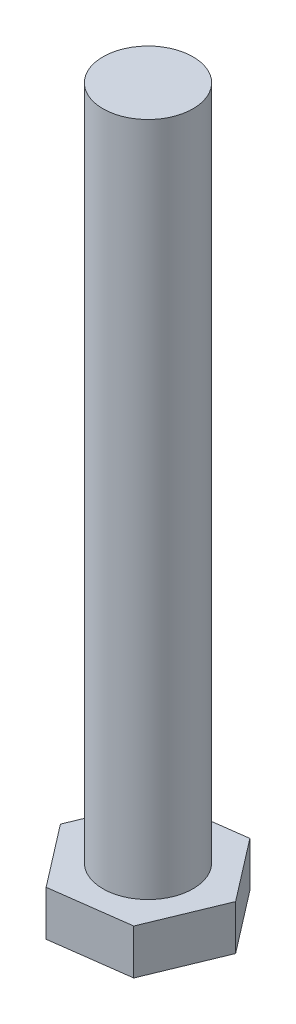
ISO-10303-21;
HEADER;
FILE_DESCRIPTION(('STEP AP214'),'2;1');
FILE_NAME('part.step','',(''),(''),'','','');
FILE_SCHEMA(('AUTOMOTIVE_DESIGN { 1 0 10303 214 1 1 1 1 }'));
ENDSEC;
DATA;
#1=APPLICATION_CONTEXT('core data for automotive mechanical design processes');
#2=APPLICATION_PROTOCOL_DEFINITION('international standard','automotive_design',2000,#1);
#3=PRODUCT_CONTEXT('',#1,'mechanical');
#4=PRODUCT('Part','Part','',(#3));
#5=PRODUCT_RELATED_PRODUCT_CATEGORY('part','',(#4));
#6=PRODUCT_DEFINITION_FORMATION('','',#4);
#7=PRODUCT_DEFINITION_CONTEXT('part definition',#1,'design');
#8=PRODUCT_DEFINITION('design','',#6,#7);
#9=PRODUCT_DEFINITION_SHAPE('','',#8);
#10=(LENGTH_UNIT() NAMED_UNIT(*) SI_UNIT(.MILLI.,.METRE.));
#11=(NAMED_UNIT(*) PLANE_ANGLE_UNIT() SI_UNIT($,.RADIAN.));
#12=(NAMED_UNIT(*) SI_UNIT($,.STERADIAN.) SOLID_ANGLE_UNIT());
#13=UNCERTAINTY_MEASURE_WITH_UNIT(LENGTH_MEASURE(1.E-05),#10,'distance_accuracy_value','');
#14=(GEOMETRIC_REPRESENTATION_CONTEXT(3) GLOBAL_UNCERTAINTY_ASSIGNED_CONTEXT((#13)) GLOBAL_UNIT_ASSIGNED_CONTEXT((#10,
#11,#12)) REPRESENTATION_CONTEXT('',''));
#15=CARTESIAN_POINT('',(0.,0.,0.));
#16=DIRECTION('',(0.,0.,1.));
#17=DIRECTION('',(1.,0.,0.));
#18=AXIS2_PLACEMENT_3D('',#15,#16,#17);
#19=CARTESIAN_POINT('',(0.,2.,0.));
#20=DIRECTION('',(0.,1.,0.));
#21=DIRECTION('',(0.,0.,1.));
#22=AXIS2_PLACEMENT_3D('',#19,#20,#21);
#23=PLANE('',#22);
#24=DIRECTION('',(0.991287890638389,0.,-0.13171301330428));
#25=VECTOR('',#24,1.);
#26=CARTESIAN_POINT('',(-1.32182195160064,2.,3.20199730297618));
#27=LINE('',#26,#25);
#28=CARTESIAN_POINT('',(-1.32182195160064,2.,3.20199730297618));
#29=VERTEX_POINT('',#28);
#30=CARTESIAN_POINT('',(2.11210003142631,2.,2.74573004085416));
#31=VERTEX_POINT('',#30);
#32=EDGE_CURVE('E129',#29,#31,#27,.T.);
#33=ORIENTED_EDGE('',*,*,#32,.T.);
#34=DIRECTION('',(0.38157712978869,0.,-0.924337002408876));
#35=VECTOR('',#34,1.);
#36=CARTESIAN_POINT('',(2.11210003142631,2.,2.74573004085416));
#37=LINE('',#36,#35);
#38=CARTESIAN_POINT('',(3.43392198302694,2.,-0.456267262122023));
#39=VERTEX_POINT('',#38);
#40=EDGE_CURVE('E87',#31,#39,#37,.T.);
#41=ORIENTED_EDGE('',*,*,#40,.T.);
#42=DIRECTION('',(-0.6097107608497,0.,-0.792623989104594));
#43=VECTOR('',#42,1.);
#44=CARTESIAN_POINT('',(3.43392198302694,2.,-0.456267262122023));
#45=LINE('',#44,#43);
#46=CARTESIAN_POINT('',(1.32182195160062,2.,-3.20199730297618));
#47=VERTEX_POINT('',#46);
#48=EDGE_CURVE('E100',#39,#47,#45,.T.);
#49=ORIENTED_EDGE('',*,*,#48,.T.);
#50=DIRECTION('',(-0.991287890638389,0.,0.131713013304283));
#51=VECTOR('',#50,1.);
#52=CARTESIAN_POINT('',(1.32182195160062,2.,-3.20199730297618));
#53=LINE('',#52,#51);
#54=CARTESIAN_POINT('',(-2.11210003142631,2.,-2.74573004085415));
#55=VERTEX_POINT('',#54);
#56=EDGE_CURVE('E94',#47,#55,#53,.T.);
#57=ORIENTED_EDGE('',*,*,#56,.T.);
#58=DIRECTION('',(-0.381577129788689,0.,0.924337002408876));
#59=VECTOR('',#58,1.);
#60=CARTESIAN_POINT('',(-2.11210003142631,2.,-2.74573004085415));
#61=LINE('',#60,#59);
#62=CARTESIAN_POINT('',(-3.43392198302694,2.,0.456267262122029));
#63=VERTEX_POINT('',#62);
#64=EDGE_CURVE('E98',#55,#63,#61,.T.);
#65=ORIENTED_EDGE('',*,*,#64,.T.);
#66=DIRECTION('',(0.609710760849698,0.,0.792623989104596));
#67=VECTOR('',#66,1.);
#68=CARTESIAN_POINT('',(-3.43392198302694,2.,0.456267262122029));
#69=LINE('',#68,#67);
#70=EDGE_CURVE('E50',#63,#29,#69,.T.);
#71=ORIENTED_EDGE('',*,*,#70,.T.);
#72=EDGE_LOOP('',(#33,#41,#49,#57,#65,#71));
#73=FACE_BOUND('',#72,.T.);
#74=CARTESIAN_POINT('',(0.,2.,0.));
#75=DIRECTION('',(0.,1.,0.));
#76=DIRECTION('',(0.,0.,1.));
#77=AXIS2_PLACEMENT_3D('',#74,#75,#76);
#78=CIRCLE('',#77,2.);
#79=CARTESIAN_POINT('',(0.,2.,2.));
#80=VERTEX_POINT('',#79);
#81=EDGE_CURVE('E169',#80,#80,#78,.T.);
#82=ORIENTED_EDGE('',*,*,#81,.F.);
#83=EDGE_LOOP('',(#82));
#84=FACE_BOUND('',#83,.T.);
#85=ADVANCED_FACE('F33',(#73,#84),#23,.T.);
#86=CARTESIAN_POINT('',(-1.32182195160064,2.,3.20199730297618));
#87=DIRECTION('',(-0.13171301330428,0.,-0.991287890638389));
#88=DIRECTION('',(-0.991287890638389,0.,0.13171301330428));
#89=AXIS2_PLACEMENT_3D('',#86,#87,#88);
#90=PLANE('',#89);
#91=DIRECTION('',(0.991287890638389,0.,-0.13171301330428));
#92=VECTOR('',#91,1.);
#93=CARTESIAN_POINT('',(-1.32182195160064,0.,3.20199730297618));
#94=LINE('',#93,#92);
#95=CARTESIAN_POINT('',(-1.32182195160064,0.,3.20199730297618));
#96=VERTEX_POINT('',#95);
#97=CARTESIAN_POINT('',(2.11210003142631,0.,2.74573004085416));
#98=VERTEX_POINT('',#97);
#99=EDGE_CURVE('E118',#96,#98,#94,.T.);
#100=ORIENTED_EDGE('',*,*,#99,.T.);
#101=DIRECTION('',(0.,-1.,0.));
#102=VECTOR('',#101,1.);
#103=CARTESIAN_POINT('',(2.11210003142631,2.,2.74573004085416));
#104=LINE('',#103,#102);
#105=EDGE_CURVE('E11',#31,#98,#104,.T.);
#106=ORIENTED_EDGE('',*,*,#105,.F.);
#107=ORIENTED_EDGE('',*,*,#32,.F.);
#108=DIRECTION('',(0.,-1.,0.));
#109=VECTOR('',#108,1.);
#110=CARTESIAN_POINT('',(-1.32182195160064,2.,3.20199730297618));
#111=LINE('',#110,#109);
#112=EDGE_CURVE('E114',#29,#96,#111,.T.);
#113=ORIENTED_EDGE('',*,*,#112,.T.);
#114=EDGE_LOOP('',(#100,#106,#107,#113));
#115=FACE_BOUND('',#114,.T.);
#116=ADVANCED_FACE('F35',(#115),#90,.F.);
#117=CARTESIAN_POINT('',(2.11210003142631,2.,2.74573004085416));
#118=DIRECTION('',(-0.924337002408875,0.,-0.38157712978869));
#119=DIRECTION('',(-0.38157712978869,0.,0.924337002408876));
#120=AXIS2_PLACEMENT_3D('',#117,#118,#119);
#121=PLANE('',#120);
#122=DIRECTION('',(0.38157712978869,0.,-0.924337002408876));
#123=VECTOR('',#122,1.);
#124=CARTESIAN_POINT('',(2.11210003142631,0.,2.74573004085416));
#125=LINE('',#124,#123);
#126=CARTESIAN_POINT('',(3.43392198302694,0.,-0.456267262122023));
#127=VERTEX_POINT('',#126);
#128=EDGE_CURVE('E121',#98,#127,#125,.T.);
#129=ORIENTED_EDGE('',*,*,#128,.T.);
#130=DIRECTION('',(0.,-1.,0.));
#131=VECTOR('',#130,1.);
#132=CARTESIAN_POINT('',(3.43392198302694,2.,-0.456267262122023));
#133=LINE('',#132,#131);
#134=EDGE_CURVE('E42',#39,#127,#133,.T.);
#135=ORIENTED_EDGE('',*,*,#134,.F.);
#136=ORIENTED_EDGE('',*,*,#40,.F.);
#137=ORIENTED_EDGE('',*,*,#105,.T.);
#138=EDGE_LOOP('',(#129,#135,#136,#137));
#139=FACE_BOUND('',#138,.T.);
#140=ADVANCED_FACE('F157',(#139),#121,.F.);
#141=CARTESIAN_POINT('',(3.43392198302694,2.,-0.456267262122023));
#142=DIRECTION('',(-0.792623989104594,0.,0.6097107608497));
#143=DIRECTION('',(0.6097107608497,0.,0.792623989104594));
#144=AXIS2_PLACEMENT_3D('',#141,#142,#143);
#145=PLANE('',#144);
#146=DIRECTION('',(-0.6097107608497,0.,-0.792623989104594));
#147=VECTOR('',#146,1.);
#148=CARTESIAN_POINT('',(3.43392198302694,0.,-0.456267262122023));
#149=LINE('',#148,#147);
#150=CARTESIAN_POINT('',(1.32182195160062,0.,-3.20199730297618));
#151=VERTEX_POINT('',#150);
#152=EDGE_CURVE('E124',#127,#151,#149,.T.);
#153=ORIENTED_EDGE('',*,*,#152,.T.);
#154=DIRECTION('',(0.,-1.,0.));
#155=VECTOR('',#154,1.);
#156=CARTESIAN_POINT('',(1.32182195160062,2.,-3.20199730297618));
#157=LINE('',#156,#155);
#158=EDGE_CURVE('E109',#47,#151,#157,.T.);
#159=ORIENTED_EDGE('',*,*,#158,.F.);
#160=ORIENTED_EDGE('',*,*,#48,.F.);
#161=ORIENTED_EDGE('',*,*,#134,.T.);
#162=EDGE_LOOP('',(#153,#159,#160,#161));
#163=FACE_BOUND('',#162,.T.);
#164=ADVANCED_FACE('F135',(#163),#145,.F.);
#165=CARTESIAN_POINT('',(1.32182195160062,2.,-3.20199730297618));
#166=DIRECTION('',(0.131713013304283,0.,0.991287890638389));
#167=DIRECTION('',(0.991287890638389,0.,-0.131713013304283));
#168=AXIS2_PLACEMENT_3D('',#165,#166,#167);
#169=PLANE('',#168);
#170=DIRECTION('',(-0.991287890638389,0.,0.131713013304283));
#171=VECTOR('',#170,1.);
#172=CARTESIAN_POINT('',(1.32182195160062,0.,-3.20199730297618));
#173=LINE('',#172,#171);
#174=CARTESIAN_POINT('',(-2.11210003142631,0.,-2.74573004085415));
#175=VERTEX_POINT('',#174);
#176=EDGE_CURVE('E108',#151,#175,#173,.T.);
#177=ORIENTED_EDGE('',*,*,#176,.T.);
#178=DIRECTION('',(0.,-1.,0.));
#179=VECTOR('',#178,1.);
#180=CARTESIAN_POINT('',(-2.11210003142631,2.,-2.74573004085415));
#181=LINE('',#180,#179);
#182=EDGE_CURVE('E105',#55,#175,#181,.T.);
#183=ORIENTED_EDGE('',*,*,#182,.F.);
#184=ORIENTED_EDGE('',*,*,#56,.F.);
#185=ORIENTED_EDGE('',*,*,#158,.T.);
#186=EDGE_LOOP('',(#177,#183,#184,#185));
#187=FACE_BOUND('',#186,.T.);
#188=ADVANCED_FACE('F106',(#187),#169,.F.);
#189=CARTESIAN_POINT('',(-2.11210003142631,2.,-2.74573004085415));
#190=DIRECTION('',(0.924337002408876,0.,0.381577129788689));
#191=DIRECTION('',(0.381577129788689,0.,-0.924337002408876));
#192=AXIS2_PLACEMENT_3D('',#189,#190,#191);
#193=PLANE('',#192);
#194=DIRECTION('',(-0.381577129788689,0.,0.924337002408876));
#195=VECTOR('',#194,1.);
#196=CARTESIAN_POINT('',(-2.11210003142631,0.,-2.74573004085415));
#197=LINE('',#196,#195);
#198=CARTESIAN_POINT('',(-3.43392198302694,0.,0.456267262122029));
#199=VERTEX_POINT('',#198);
#200=EDGE_CURVE('E73',#175,#199,#197,.T.);
#201=ORIENTED_EDGE('',*,*,#200,.T.);
#202=DIRECTION('',(0.,-1.,0.));
#203=VECTOR('',#202,1.);
#204=CARTESIAN_POINT('',(-3.43392198302694,2.,0.456267262122029));
#205=LINE('',#204,#203);
#206=EDGE_CURVE('E110',#63,#199,#205,.T.);
#207=ORIENTED_EDGE('',*,*,#206,.F.);
#208=ORIENTED_EDGE('',*,*,#64,.F.);
#209=ORIENTED_EDGE('',*,*,#182,.T.);
#210=EDGE_LOOP('',(#201,#207,#208,#209));
#211=FACE_BOUND('',#210,.T.);
#212=ADVANCED_FACE('F112',(#211),#193,.F.);
#213=CARTESIAN_POINT('',(-3.43392198302694,2.,0.456267262122029));
#214=DIRECTION('',(0.792623989104596,0.,-0.609710760849698));
#215=DIRECTION('',(-0.609710760849698,0.,-0.792623989104596));
#216=AXIS2_PLACEMENT_3D('',#213,#214,#215);
#217=PLANE('',#216);
#218=DIRECTION('',(0.609710760849698,0.,0.792623989104596));
#219=VECTOR('',#218,1.);
#220=CARTESIAN_POINT('',(-3.43392198302694,0.,0.456267262122029));
#221=LINE('',#220,#219);
#222=EDGE_CURVE('E79',#199,#96,#221,.T.);
#223=ORIENTED_EDGE('',*,*,#222,.T.);
#224=ORIENTED_EDGE('',*,*,#112,.F.);
#225=ORIENTED_EDGE('',*,*,#70,.F.);
#226=ORIENTED_EDGE('',*,*,#206,.T.);
#227=EDGE_LOOP('',(#223,#224,#225,#226));
#228=FACE_BOUND('',#227,.T.);
#229=ADVANCED_FACE('F142',(#228),#217,.F.);
#230=CARTESIAN_POINT('',(0.,0.,0.));
#231=DIRECTION('',(0.,1.,0.));
#232=DIRECTION('',(0.,0.,1.));
#233=AXIS2_PLACEMENT_3D('',#230,#231,#232);
#234=PLANE('',#233);
#235=ORIENTED_EDGE('',*,*,#99,.F.);
#236=ORIENTED_EDGE('',*,*,#222,.F.);
#237=ORIENTED_EDGE('',*,*,#200,.F.);
#238=ORIENTED_EDGE('',*,*,#176,.F.);
#239=ORIENTED_EDGE('',*,*,#152,.F.);
#240=ORIENTED_EDGE('',*,*,#128,.F.);
#241=EDGE_LOOP('',(#235,#236,#237,#238,#239,#240));
#242=FACE_BOUND('',#241,.T.);
#243=ADVANCED_FACE('F138',(#242),#234,.F.);
#244=CARTESIAN_POINT('',(0.,32.,0.));
#245=DIRECTION('',(0.,-1.,0.));
#246=DIRECTION('',(0.,0.,-1.));
#247=AXIS2_PLACEMENT_3D('',#244,#245,#246);
#248=CYLINDRICAL_SURFACE('',#247,2.);
#249=CARTESIAN_POINT('',(0.,32.,0.));
#250=DIRECTION('',(0.,1.,0.));
#251=DIRECTION('',(0.,0.,1.));
#252=AXIS2_PLACEMENT_3D('',#249,#250,#251);
#253=CIRCLE('',#252,2.);
#254=CARTESIAN_POINT('',(0.,32.,2.));
#255=VERTEX_POINT('',#254);
#256=EDGE_CURVE('E122',#255,#255,#253,.T.);
#257=ORIENTED_EDGE('',*,*,#256,.F.);
#258=EDGE_LOOP('',(#257));
#259=FACE_BOUND('',#258,.T.);
#260=ORIENTED_EDGE('',*,*,#81,.T.);
#261=EDGE_LOOP('',(#260));
#262=FACE_BOUND('',#261,.T.);
#263=ADVANCED_FACE('F149',(#259,#262),#248,.T.);
#264=CARTESIAN_POINT('',(0.,32.,0.));
#265=DIRECTION('',(0.,1.,0.));
#266=DIRECTION('',(0.,0.,1.));
#267=AXIS2_PLACEMENT_3D('',#264,#265,#266);
#268=PLANE('',#267);
#269=ORIENTED_EDGE('',*,*,#256,.T.);
#270=EDGE_LOOP('',(#269));
#271=FACE_BOUND('',#270,.T.);
#272=ADVANCED_FACE('F161',(#271),#268,.T.);
#273=CLOSED_SHELL('',(#85,#116,#140,#164,#188,#212,#229,#243,#263,#272));
#274=MANIFOLD_SOLID_BREP('B2',#273);
#275=ADVANCED_BREP_SHAPE_REPRESENTATION('',(#18,#274),#14);
#276=SHAPE_DEFINITION_REPRESENTATION(#9,#275);
ENDSEC;
END-ISO-10303-21;
